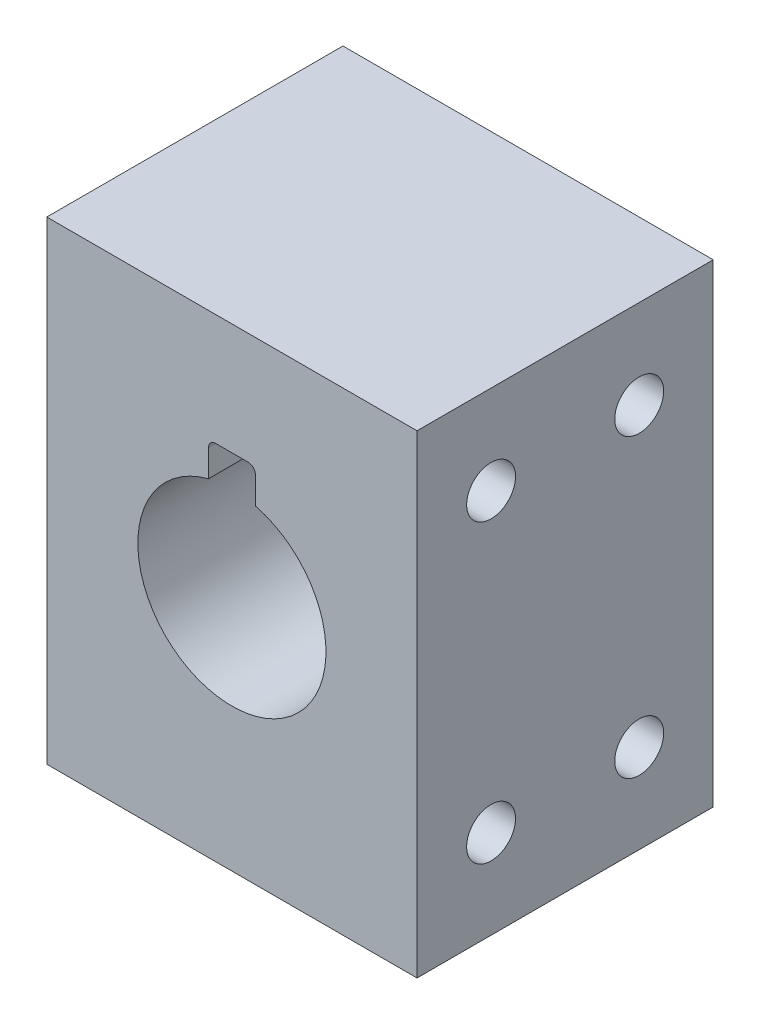
ISO-10303-21;
HEADER;
FILE_DESCRIPTION(('STEP AP214'),'2;1');
FILE_NAME('part.step','',(''),(''),'','','');
FILE_SCHEMA(('AUTOMOTIVE_DESIGN { 1 0 10303 214 1 1 1 1 }'));
ENDSEC;
DATA;
#1=APPLICATION_CONTEXT('core data for automotive mechanical design processes');
#2=APPLICATION_PROTOCOL_DEFINITION('international standard','automotive_design',2000,#1);
#3=PRODUCT_CONTEXT('',#1,'mechanical');
#4=PRODUCT('Part','Part','',(#3));
#5=PRODUCT_RELATED_PRODUCT_CATEGORY('part','',(#4));
#6=PRODUCT_DEFINITION_FORMATION('','',#4);
#7=PRODUCT_DEFINITION_CONTEXT('part definition',#1,'design');
#8=PRODUCT_DEFINITION('design','',#6,#7);
#9=PRODUCT_DEFINITION_SHAPE('','',#8);
#10=(LENGTH_UNIT() NAMED_UNIT(*) SI_UNIT(.MILLI.,.METRE.));
#11=(NAMED_UNIT(*) PLANE_ANGLE_UNIT() SI_UNIT($,.RADIAN.));
#12=(NAMED_UNIT(*) SI_UNIT($,.STERADIAN.) SOLID_ANGLE_UNIT());
#13=UNCERTAINTY_MEASURE_WITH_UNIT(LENGTH_MEASURE(1.E-05),#10,'distance_accuracy_value','');
#14=(GEOMETRIC_REPRESENTATION_CONTEXT(3) GLOBAL_UNCERTAINTY_ASSIGNED_CONTEXT((#13)) GLOBAL_UNIT_ASSIGNED_CONTEXT((#10,
#11,#12)) REPRESENTATION_CONTEXT('',''));
#15=CARTESIAN_POINT('',(0.,0.,0.));
#16=DIRECTION('',(0.,0.,1.));
#17=DIRECTION('',(1.,0.,0.));
#18=AXIS2_PLACEMENT_3D('',#15,#16,#17);
#19=CARTESIAN_POINT('',(0.,0.,20.));
#20=DIRECTION('',(-1.,0.,0.));
#21=DIRECTION('',(0.,-1.,0.));
#22=AXIS2_PLACEMENT_3D('',#19,#20,#21);
#23=PLANE('',#22);
#24=CARTESIAN_POINT('',(0.,26.,5.));
#25=DIRECTION('',(1.,0.,0.));
#26=DIRECTION('',(0.,0.,-1.));
#27=AXIS2_PLACEMENT_3D('',#24,#25,#26);
#28=CIRCLE('',#27,1.64999999999999);
#29=CARTESIAN_POINT('',(0.,26.,3.35000000000001));
#30=VERTEX_POINT('',#29);
#31=EDGE_CURVE('E152',#30,#30,#28,.T.);
#32=ORIENTED_EDGE('',*,*,#31,.F.);
#33=EDGE_LOOP('',(#32));
#34=FACE_BOUND('',#33,.T.);
#35=CARTESIAN_POINT('',(0.,5.99999999999999,15.));
#36=DIRECTION('',(1.,0.,0.));
#37=DIRECTION('',(0.,0.,-1.));
#38=AXIS2_PLACEMENT_3D('',#35,#36,#37);
#39=CIRCLE('',#38,1.64999999999999);
#40=CARTESIAN_POINT('',(0.,5.99999999999999,13.35));
#41=VERTEX_POINT('',#40);
#42=EDGE_CURVE('E151',#41,#41,#39,.T.);
#43=ORIENTED_EDGE('',*,*,#42,.F.);
#44=EDGE_LOOP('',(#43));
#45=FACE_BOUND('',#44,.T.);
#46=CARTESIAN_POINT('',(0.,5.99999999999999,5.));
#47=DIRECTION('',(1.,0.,0.));
#48=DIRECTION('',(0.,0.,-1.));
#49=AXIS2_PLACEMENT_3D('',#46,#47,#48);
#50=CIRCLE('',#49,1.64999999999999);
#51=CARTESIAN_POINT('',(0.,5.99999999999999,3.35000000000001));
#52=VERTEX_POINT('',#51);
#53=EDGE_CURVE('E165',#52,#52,#50,.T.);
#54=ORIENTED_EDGE('',*,*,#53,.F.);
#55=EDGE_LOOP('',(#54));
#56=FACE_BOUND('',#55,.T.);
#57=CARTESIAN_POINT('',(0.,26.,15.));
#58=DIRECTION('',(1.,0.,0.));
#59=DIRECTION('',(0.,0.,-1.));
#60=AXIS2_PLACEMENT_3D('',#57,#58,#59);
#61=CIRCLE('',#60,1.64999999999999);
#62=CARTESIAN_POINT('',(0.,26.,13.35));
#63=VERTEX_POINT('',#62);
#64=EDGE_CURVE('E173',#63,#63,#61,.T.);
#65=ORIENTED_EDGE('',*,*,#64,.F.);
#66=EDGE_LOOP('',(#65));
#67=FACE_BOUND('',#66,.T.);
#68=DIRECTION('',(0.,1.,0.));
#69=VECTOR('',#68,1.);
#70=CARTESIAN_POINT('',(0.,0.,0.));
#71=LINE('',#70,#69);
#72=CARTESIAN_POINT('',(0.,0.,0.));
#73=VERTEX_POINT('',#72);
#74=CARTESIAN_POINT('',(0.,32.,0.));
#75=VERTEX_POINT('',#74);
#76=EDGE_CURVE('E246',#73,#75,#71,.T.);
#77=ORIENTED_EDGE('',*,*,#76,.T.);
#78=DIRECTION('',(0.,0.,-1.));
#79=VECTOR('',#78,1.);
#80=CARTESIAN_POINT('',(0.,32.,20.));
#81=LINE('',#80,#79);
#82=CARTESIAN_POINT('',(0.,32.,20.));
#83=VERTEX_POINT('',#82);
#84=EDGE_CURVE('E287',#83,#75,#81,.T.);
#85=ORIENTED_EDGE('',*,*,#84,.F.);
#86=DIRECTION('',(0.,1.,0.));
#87=VECTOR('',#86,1.);
#88=CARTESIAN_POINT('',(0.,0.,20.));
#89=LINE('',#88,#87);
#90=CARTESIAN_POINT('',(0.,0.,20.));
#91=VERTEX_POINT('',#90);
#92=EDGE_CURVE('E250',#91,#83,#89,.T.);
#93=ORIENTED_EDGE('',*,*,#92,.F.);
#94=DIRECTION('',(0.,0.,-1.));
#95=VECTOR('',#94,1.);
#96=CARTESIAN_POINT('',(0.,0.,20.));
#97=LINE('',#96,#95);
#98=EDGE_CURVE('E264',#91,#73,#97,.T.);
#99=ORIENTED_EDGE('',*,*,#98,.T.);
#100=EDGE_LOOP('',(#77,#85,#93,#99));
#101=FACE_BOUND('',#100,.T.);
#102=ADVANCED_FACE('F41',(#34,#45,#56,#67,#101),#23,.F.);
#103=CARTESIAN_POINT('',(0.,32.,20.));
#104=DIRECTION('',(0.,-1.,0.));
#105=DIRECTION('',(0.,0.,-1.));
#106=AXIS2_PLACEMENT_3D('',#103,#104,#105);
#107=PLANE('',#106);
#108=DIRECTION('',(-1.,0.,0.));
#109=VECTOR('',#108,1.);
#110=CARTESIAN_POINT('',(0.,32.,0.));
#111=LINE('',#110,#109);
#112=CARTESIAN_POINT('',(-25.,32.,0.));
#113=VERTEX_POINT('',#112);
#114=EDGE_CURVE('E268',#75,#113,#111,.T.);
#115=ORIENTED_EDGE('',*,*,#114,.T.);
#116=DIRECTION('',(0.,0.,-1.));
#117=VECTOR('',#116,1.);
#118=CARTESIAN_POINT('',(-25.,32.,20.));
#119=LINE('',#118,#117);
#120=CARTESIAN_POINT('',(-25.,32.,20.));
#121=VERTEX_POINT('',#120);
#122=EDGE_CURVE('E283',#121,#113,#119,.T.);
#123=ORIENTED_EDGE('',*,*,#122,.F.);
#124=DIRECTION('',(-1.,0.,0.));
#125=VECTOR('',#124,1.);
#126=CARTESIAN_POINT('',(0.,32.,20.));
#127=LINE('',#126,#125);
#128=EDGE_CURVE('E254',#83,#121,#127,.T.);
#129=ORIENTED_EDGE('',*,*,#128,.F.);
#130=ORIENTED_EDGE('',*,*,#84,.T.);
#131=EDGE_LOOP('',(#115,#123,#129,#130));
#132=FACE_BOUND('',#131,.T.);
#133=ADVANCED_FACE('F344',(#132),#107,.F.);
#134=CARTESIAN_POINT('',(-25.,0.,20.));
#135=DIRECTION('',(1.,0.,0.));
#136=DIRECTION('',(0.,0.,-1.));
#137=AXIS2_PLACEMENT_3D('',#134,#135,#136);
#138=PLANE('',#137);
#139=CARTESIAN_POINT('',(-25.,26.,5.));
#140=DIRECTION('',(-1.,0.,0.));
#141=DIRECTION('',(0.,0.,1.));
#142=AXIS2_PLACEMENT_3D('',#139,#140,#141);
#143=CIRCLE('',#142,1.64999999999999);
#144=CARTESIAN_POINT('',(-25.,26.,6.64999999999999));
#145=VERTEX_POINT('',#144);
#146=EDGE_CURVE('E181',#145,#145,#143,.T.);
#147=ORIENTED_EDGE('',*,*,#146,.F.);
#148=EDGE_LOOP('',(#147));
#149=FACE_BOUND('',#148,.T.);
#150=CARTESIAN_POINT('',(-25.,5.99999999999999,15.));
#151=DIRECTION('',(-1.,0.,0.));
#152=DIRECTION('',(0.,0.,1.));
#153=AXIS2_PLACEMENT_3D('',#150,#151,#152);
#154=CIRCLE('',#153,1.64999999999999);
#155=CARTESIAN_POINT('',(-25.,5.99999999999999,16.65));
#156=VERTEX_POINT('',#155);
#157=EDGE_CURVE('E189',#156,#156,#154,.T.);
#158=ORIENTED_EDGE('',*,*,#157,.F.);
#159=EDGE_LOOP('',(#158));
#160=FACE_BOUND('',#159,.T.);
#161=CARTESIAN_POINT('',(-25.,5.99999999999999,5.));
#162=DIRECTION('',(-1.,0.,0.));
#163=DIRECTION('',(0.,0.,1.));
#164=AXIS2_PLACEMENT_3D('',#161,#162,#163);
#165=CIRCLE('',#164,1.64999999999999);
#166=CARTESIAN_POINT('',(-25.,5.99999999999999,6.64999999999999));
#167=VERTEX_POINT('',#166);
#168=EDGE_CURVE('E197',#167,#167,#165,.T.);
#169=ORIENTED_EDGE('',*,*,#168,.F.);
#170=EDGE_LOOP('',(#169));
#171=FACE_BOUND('',#170,.T.);
#172=CARTESIAN_POINT('',(-25.,26.,15.));
#173=DIRECTION('',(-1.,0.,0.));
#174=DIRECTION('',(0.,0.,1.));
#175=AXIS2_PLACEMENT_3D('',#172,#173,#174);
#176=CIRCLE('',#175,1.64999999999999);
#177=CARTESIAN_POINT('',(-25.,26.,16.65));
#178=VERTEX_POINT('',#177);
#179=EDGE_CURVE('E205',#178,#178,#176,.T.);
#180=ORIENTED_EDGE('',*,*,#179,.F.);
#181=EDGE_LOOP('',(#180));
#182=FACE_BOUND('',#181,.T.);
#183=DIRECTION('',(0.,-1.,0.));
#184=VECTOR('',#183,1.);
#185=CARTESIAN_POINT('',(-25.,0.,0.));
#186=LINE('',#185,#184);
#187=CARTESIAN_POINT('',(-25.,0.,0.));
#188=VERTEX_POINT('',#187);
#189=EDGE_CURVE('E271',#113,#188,#186,.T.);
#190=ORIENTED_EDGE('',*,*,#189,.T.);
#191=DIRECTION('',(0.,0.,-1.));
#192=VECTOR('',#191,1.);
#193=CARTESIAN_POINT('',(-25.,0.,20.));
#194=LINE('',#193,#192);
#195=CARTESIAN_POINT('',(-25.,0.,20.));
#196=VERTEX_POINT('',#195);
#197=EDGE_CURVE('E279',#196,#188,#194,.T.);
#198=ORIENTED_EDGE('',*,*,#197,.F.);
#199=DIRECTION('',(0.,-1.,0.));
#200=VECTOR('',#199,1.);
#201=CARTESIAN_POINT('',(-25.,0.,20.));
#202=LINE('',#201,#200);
#203=EDGE_CURVE('E258',#121,#196,#202,.T.);
#204=ORIENTED_EDGE('',*,*,#203,.F.);
#205=ORIENTED_EDGE('',*,*,#122,.T.);
#206=EDGE_LOOP('',(#190,#198,#204,#205));
#207=FACE_BOUND('',#206,.T.);
#208=ADVANCED_FACE('F349',(#149,#160,#171,#182,#207),#138,.F.);
#209=CARTESIAN_POINT('',(0.,0.,20.));
#210=DIRECTION('',(0.,1.,0.));
#211=DIRECTION('',(-1.,0.,0.));
#212=AXIS2_PLACEMENT_3D('',#209,#210,#211);
#213=PLANE('',#212);
#214=DIRECTION('',(1.,0.,0.));
#215=VECTOR('',#214,1.);
#216=CARTESIAN_POINT('',(0.,0.,0.));
#217=LINE('',#216,#215);
#218=EDGE_CURVE('E255',#188,#73,#217,.T.);
#219=ORIENTED_EDGE('',*,*,#218,.T.);
#220=ORIENTED_EDGE('',*,*,#98,.F.);
#221=DIRECTION('',(1.,0.,0.));
#222=VECTOR('',#221,1.);
#223=CARTESIAN_POINT('',(0.,0.,20.));
#224=LINE('',#223,#222);
#225=EDGE_CURVE('E261',#196,#91,#224,.T.);
#226=ORIENTED_EDGE('',*,*,#225,.F.);
#227=ORIENTED_EDGE('',*,*,#197,.T.);
#228=EDGE_LOOP('',(#219,#220,#226,#227));
#229=FACE_BOUND('',#228,.T.);
#230=ADVANCED_FACE('F357',(#229),#213,.F.);
#231=CARTESIAN_POINT('',(0.,0.,20.));
#232=DIRECTION('',(0.,0.,1.));
#233=DIRECTION('',(1.,0.,0.));
#234=AXIS2_PLACEMENT_3D('',#231,#232,#233);
#235=PLANE('',#234);
#236=CARTESIAN_POINT('',(-12.5,16.,20.));
#237=DIRECTION('',(0.,0.,1.));
#238=DIRECTION('',(1.,0.,0.));
#239=AXIS2_PLACEMENT_3D('',#236,#237,#238);
#240=CIRCLE('',#239,6.35);
#241=CARTESIAN_POINT('',(-14.0875,22.1483610621043,20.));
#242=VERTEX_POINT('',#241);
#243=CARTESIAN_POINT('',(-10.9125,22.1483610621043,20.));
#244=VERTEX_POINT('',#243);
#245=EDGE_CURVE('E213',#242,#244,#240,.T.);
#246=ORIENTED_EDGE('',*,*,#245,.F.);
#247=DIRECTION('',(0.,-1.,0.));
#248=VECTOR('',#247,1.);
#249=CARTESIAN_POINT('',(-14.0875,0.,20.));
#250=LINE('',#249,#248);
#251=CARTESIAN_POINT('',(-14.0875,23.9625,20.));
#252=VERTEX_POINT('',#251);
#253=EDGE_CURVE('E219',#252,#242,#250,.T.);
#254=ORIENTED_EDGE('',*,*,#253,.F.);
#255=CARTESIAN_POINT('',(-13.5875,23.9625,20.));
#256=DIRECTION('',(0.,0.,1.));
#257=DIRECTION('',(1.,0.,0.));
#258=AXIS2_PLACEMENT_3D('',#255,#256,#257);
#259=CIRCLE('',#258,0.5);
#260=CARTESIAN_POINT('',(-13.5875,24.4625,20.));
#261=VERTEX_POINT('',#260);
#262=EDGE_CURVE('E50',#252,#261,#259,.F.);
#263=ORIENTED_EDGE('',*,*,#262,.T.);
#264=DIRECTION('',(1.,0.,0.));
#265=VECTOR('',#264,1.);
#266=CARTESIAN_POINT('',(0.,24.4625,20.));
#267=LINE('',#266,#265);
#268=CARTESIAN_POINT('',(-11.4125,24.4625,20.));
#269=VERTEX_POINT('',#268);
#270=EDGE_CURVE('E236',#261,#269,#267,.T.);
#271=ORIENTED_EDGE('',*,*,#270,.T.);
#272=CARTESIAN_POINT('',(-11.4125,23.9625,20.));
#273=DIRECTION('',(0.,0.,1.));
#274=DIRECTION('',(1.,0.,0.));
#275=AXIS2_PLACEMENT_3D('',#272,#273,#274);
#276=CIRCLE('',#275,0.5);
#277=CARTESIAN_POINT('',(-10.9125,23.9625,20.));
#278=VERTEX_POINT('',#277);
#279=EDGE_CURVE('E304',#269,#278,#276,.F.);
#280=ORIENTED_EDGE('',*,*,#279,.T.);
#281=DIRECTION('',(0.,-1.,0.));
#282=VECTOR('',#281,1.);
#283=CARTESIAN_POINT('',(-10.9125,0.,20.));
#284=LINE('',#283,#282);
#285=EDGE_CURVE('E233',#278,#244,#284,.T.);
#286=ORIENTED_EDGE('',*,*,#285,.T.);
#287=EDGE_LOOP('',(#246,#254,#263,#271,#280,#286));
#288=FACE_BOUND('',#287,.T.);
#289=ORIENTED_EDGE('',*,*,#92,.T.);
#290=ORIENTED_EDGE('',*,*,#128,.T.);
#291=ORIENTED_EDGE('',*,*,#203,.T.);
#292=ORIENTED_EDGE('',*,*,#225,.T.);
#293=EDGE_LOOP('',(#289,#290,#291,#292));
#294=FACE_BOUND('',#293,.T.);
#295=ADVANCED_FACE('F314',(#288,#294),#235,.T.);
#296=CARTESIAN_POINT('',(0.,0.,0.));
#297=DIRECTION('',(0.,0.,1.));
#298=DIRECTION('',(1.,0.,0.));
#299=AXIS2_PLACEMENT_3D('',#296,#297,#298);
#300=PLANE('',#299);
#301=DIRECTION('',(1.,0.,0.));
#302=VECTOR('',#301,1.);
#303=CARTESIAN_POINT('',(0.,24.4625,0.));
#304=LINE('',#303,#302);
#305=CARTESIAN_POINT('',(-13.5875,24.4625,0.));
#306=VERTEX_POINT('',#305);
#307=CARTESIAN_POINT('',(-11.4125,24.4625,0.));
#308=VERTEX_POINT('',#307);
#309=EDGE_CURVE('E222',#306,#308,#304,.T.);
#310=ORIENTED_EDGE('',*,*,#309,.F.);
#311=CARTESIAN_POINT('',(-13.5875,23.9625,0.));
#312=DIRECTION('',(0.,0.,1.));
#313=DIRECTION('',(1.,0.,0.));
#314=AXIS2_PLACEMENT_3D('',#311,#312,#313);
#315=CIRCLE('',#314,0.5);
#316=CARTESIAN_POINT('',(-14.0875,23.9625,0.));
#317=VERTEX_POINT('',#316);
#318=EDGE_CURVE('E11',#306,#317,#315,.T.);
#319=ORIENTED_EDGE('',*,*,#318,.T.);
#320=DIRECTION('',(0.,-1.,0.));
#321=VECTOR('',#320,1.);
#322=CARTESIAN_POINT('',(-14.0875,0.,0.));
#323=LINE('',#322,#321);
#324=CARTESIAN_POINT('',(-14.0875,22.1483610621043,0.));
#325=VERTEX_POINT('',#324);
#326=EDGE_CURVE('E226',#317,#325,#323,.T.);
#327=ORIENTED_EDGE('',*,*,#326,.T.);
#328=CARTESIAN_POINT('',(-12.5,16.,0.));
#329=DIRECTION('',(0.,0.,1.));
#330=DIRECTION('',(1.,0.,0.));
#331=AXIS2_PLACEMENT_3D('',#328,#329,#330);
#332=CIRCLE('',#331,6.35);
#333=CARTESIAN_POINT('',(-10.9125,22.1483610621043,0.));
#334=VERTEX_POINT('',#333);
#335=EDGE_CURVE('E214',#325,#334,#332,.T.);
#336=ORIENTED_EDGE('',*,*,#335,.T.);
#337=DIRECTION('',(0.,-1.,0.));
#338=VECTOR('',#337,1.);
#339=CARTESIAN_POINT('',(-10.9125,0.,0.));
#340=LINE('',#339,#338);
#341=CARTESIAN_POINT('',(-10.9125,23.9625,0.));
#342=VERTEX_POINT('',#341);
#343=EDGE_CURVE('E218',#342,#334,#340,.T.);
#344=ORIENTED_EDGE('',*,*,#343,.F.);
#345=CARTESIAN_POINT('',(-11.4125,23.9625,0.));
#346=DIRECTION('',(0.,0.,1.));
#347=DIRECTION('',(1.,0.,0.));
#348=AXIS2_PLACEMENT_3D('',#345,#346,#347);
#349=CIRCLE('',#348,0.5);
#350=EDGE_CURVE('E307',#342,#308,#349,.T.);
#351=ORIENTED_EDGE('',*,*,#350,.T.);
#352=EDGE_LOOP('',(#310,#319,#327,#336,#344,#351));
#353=FACE_BOUND('',#352,.T.);
#354=ORIENTED_EDGE('',*,*,#76,.F.);
#355=ORIENTED_EDGE('',*,*,#218,.F.);
#356=ORIENTED_EDGE('',*,*,#189,.F.);
#357=ORIENTED_EDGE('',*,*,#114,.F.);
#358=EDGE_LOOP('',(#354,#355,#356,#357));
#359=FACE_BOUND('',#358,.T.);
#360=ADVANCED_FACE('F323',(#353,#359),#300,.F.);
#361=CARTESIAN_POINT('',(-12.5,16.,0.));
#362=DIRECTION('',(0.,0.,1.));
#363=DIRECTION('',(1.,0.,0.));
#364=AXIS2_PLACEMENT_3D('',#361,#362,#363);
#365=CYLINDRICAL_SURFACE('',#364,6.35);
#366=ORIENTED_EDGE('',*,*,#245,.T.);
#367=DIRECTION('',(0.,0.,1.));
#368=VECTOR('',#367,1.);
#369=CARTESIAN_POINT('',(-10.9125,22.1483610621043,0.));
#370=LINE('',#369,#368);
#371=EDGE_CURVE('E229',#334,#244,#370,.T.);
#372=ORIENTED_EDGE('',*,*,#371,.F.);
#373=ORIENTED_EDGE('',*,*,#335,.F.);
#374=DIRECTION('',(0.,0.,1.));
#375=VECTOR('',#374,1.);
#376=CARTESIAN_POINT('',(-14.0875,22.1483610621043,0.));
#377=LINE('',#376,#375);
#378=EDGE_CURVE('E242',#325,#242,#377,.T.);
#379=ORIENTED_EDGE('',*,*,#378,.T.);
#380=EDGE_LOOP('',(#366,#372,#373,#379));
#381=FACE_BOUND('',#380,.T.);
#382=ADVANCED_FACE('F329',(#381),#365,.F.);
#383=CARTESIAN_POINT('',(-14.0875,0.,0.));
#384=DIRECTION('',(-1.,0.,0.));
#385=DIRECTION('',(0.,-1.,0.));
#386=AXIS2_PLACEMENT_3D('',#383,#384,#385);
#387=PLANE('',#386);
#388=ORIENTED_EDGE('',*,*,#326,.F.);
#389=DIRECTION('',(0.,0.,1.));
#390=VECTOR('',#389,1.);
#391=CARTESIAN_POINT('',(-14.0875,23.9625,0.));
#392=LINE('',#391,#390);
#393=EDGE_CURVE('E301',#317,#252,#392,.T.);
#394=ORIENTED_EDGE('',*,*,#393,.T.);
#395=ORIENTED_EDGE('',*,*,#253,.T.);
#396=ORIENTED_EDGE('',*,*,#378,.F.);
#397=EDGE_LOOP('',(#388,#394,#395,#396));
#398=FACE_BOUND('',#397,.T.);
#399=ADVANCED_FACE('F320',(#398),#387,.F.);
#400=CARTESIAN_POINT('',(0.,24.4625,0.));
#401=DIRECTION('',(0.,-1.,0.));
#402=DIRECTION('',(0.,0.,-1.));
#403=AXIS2_PLACEMENT_3D('',#400,#401,#402);
#404=PLANE('',#403);
#405=ORIENTED_EDGE('',*,*,#309,.T.);
#406=DIRECTION('',(0.,0.,1.));
#407=VECTOR('',#406,1.);
#408=CARTESIAN_POINT('',(-11.4125,24.4625,20.));
#409=LINE('',#408,#407);
#410=EDGE_CURVE('E294',#308,#269,#409,.T.);
#411=ORIENTED_EDGE('',*,*,#410,.T.);
#412=ORIENTED_EDGE('',*,*,#270,.F.);
#413=DIRECTION('',(0.,0.,1.));
#414=VECTOR('',#413,1.);
#415=CARTESIAN_POINT('',(-13.5875,24.4625,0.));
#416=LINE('',#415,#414);
#417=EDGE_CURVE('E291',#261,#306,#416,.F.);
#418=ORIENTED_EDGE('',*,*,#417,.T.);
#419=EDGE_LOOP('',(#405,#411,#412,#418));
#420=FACE_BOUND('',#419,.T.);
#421=ADVANCED_FACE('F317',(#420),#404,.T.);
#422=CARTESIAN_POINT('',(-10.9125,0.,0.));
#423=DIRECTION('',(-1.,0.,0.));
#424=DIRECTION('',(0.,-1.,0.));
#425=AXIS2_PLACEMENT_3D('',#422,#423,#424);
#426=PLANE('',#425);
#427=ORIENTED_EDGE('',*,*,#285,.F.);
#428=DIRECTION('',(0.,0.,1.));
#429=VECTOR('',#428,1.);
#430=CARTESIAN_POINT('',(-10.9125,23.9625,0.));
#431=LINE('',#430,#429);
#432=EDGE_CURVE('E298',#278,#342,#431,.F.);
#433=ORIENTED_EDGE('',*,*,#432,.T.);
#434=ORIENTED_EDGE('',*,*,#343,.T.);
#435=ORIENTED_EDGE('',*,*,#371,.T.);
#436=EDGE_LOOP('',(#427,#433,#434,#435));
#437=FACE_BOUND('',#436,.T.);
#438=ADVANCED_FACE('F332',(#437),#426,.T.);
#439=CARTESIAN_POINT('',(-18.,26.,15.));
#440=DIRECTION('',(-1.,0.,0.));
#441=DIRECTION('',(0.,0.,1.));
#442=AXIS2_PLACEMENT_3D('',#439,#440,#441);
#443=CONICAL_SURFACE('',#442,1.65,1.02974425867665);
#444=CARTESIAN_POINT('',(-17.0085799786045,26.,15.));
#445=VERTEX_POINT('',#444);
#446=VERTEX_LOOP('',#445);
#447=FACE_BOUND('',#446,.T.);
#448=CARTESIAN_POINT('',(-18.,26.,15.));
#449=DIRECTION('',(-1.,0.,0.));
#450=DIRECTION('',(0.,0.,1.));
#451=AXIS2_PLACEMENT_3D('',#448,#449,#450);
#452=CIRCLE('',#451,1.65);
#453=CARTESIAN_POINT('',(-18.,26.,16.65));
#454=VERTEX_POINT('',#453);
#455=EDGE_CURVE('E209',#454,#454,#452,.T.);
#456=ORIENTED_EDGE('',*,*,#455,.T.);
#457=EDGE_LOOP('',(#456));
#458=FACE_BOUND('',#457,.T.);
#459=ADVANCED_FACE('F370',(#447,#458),#443,.F.);
#460=CARTESIAN_POINT('',(-25.,26.,15.));
#461=DIRECTION('',(-1.,0.,0.));
#462=DIRECTION('',(0.,0.,1.));
#463=AXIS2_PLACEMENT_3D('',#460,#461,#462);
#464=CYLINDRICAL_SURFACE('',#463,1.65);
#465=ORIENTED_EDGE('',*,*,#455,.F.);
#466=EDGE_LOOP('',(#465));
#467=FACE_BOUND('',#466,.T.);
#468=ORIENTED_EDGE('',*,*,#179,.T.);
#469=EDGE_LOOP('',(#468));
#470=FACE_BOUND('',#469,.T.);
#471=ADVANCED_FACE('F377',(#467,#470),#464,.F.);
#472=CARTESIAN_POINT('',(-18.,5.99999999999999,5.));
#473=DIRECTION('',(-1.,0.,0.));
#474=DIRECTION('',(0.,0.,1.));
#475=AXIS2_PLACEMENT_3D('',#472,#473,#474);
#476=CONICAL_SURFACE('',#475,1.65,1.02974425867665);
#477=CARTESIAN_POINT('',(-17.0085799786045,5.99999999999999,5.));
#478=VERTEX_POINT('',#477);
#479=VERTEX_LOOP('',#478);
#480=FACE_BOUND('',#479,.T.);
#481=CARTESIAN_POINT('',(-18.,5.99999999999999,5.));
#482=DIRECTION('',(-1.,0.,0.));
#483=DIRECTION('',(0.,0.,1.));
#484=AXIS2_PLACEMENT_3D('',#481,#482,#483);
#485=CIRCLE('',#484,1.65);
#486=CARTESIAN_POINT('',(-18.,5.99999999999999,6.64999999999999));
#487=VERTEX_POINT('',#486);
#488=EDGE_CURVE('E201',#487,#487,#485,.T.);
#489=ORIENTED_EDGE('',*,*,#488,.T.);
#490=EDGE_LOOP('',(#489));
#491=FACE_BOUND('',#490,.T.);
#492=ADVANCED_FACE('F381',(#480,#491),#476,.F.);
#493=CARTESIAN_POINT('',(-25.,5.99999999999999,5.));
#494=DIRECTION('',(-1.,0.,0.));
#495=DIRECTION('',(0.,0.,1.));
#496=AXIS2_PLACEMENT_3D('',#493,#494,#495);
#497=CYLINDRICAL_SURFACE('',#496,1.64999999999999);
#498=ORIENTED_EDGE('',*,*,#488,.F.);
#499=EDGE_LOOP('',(#498));
#500=FACE_BOUND('',#499,.T.);
#501=ORIENTED_EDGE('',*,*,#168,.T.);
#502=EDGE_LOOP('',(#501));
#503=FACE_BOUND('',#502,.T.);
#504=ADVANCED_FACE('F385',(#500,#503),#497,.F.);
#505=CARTESIAN_POINT('',(-18.,5.99999999999999,15.));
#506=DIRECTION('',(-1.,0.,0.));
#507=DIRECTION('',(0.,0.,1.));
#508=AXIS2_PLACEMENT_3D('',#505,#506,#507);
#509=CONICAL_SURFACE('',#508,1.65,1.02974425867665);
#510=CARTESIAN_POINT('',(-17.0085799786045,5.99999999999999,15.));
#511=VERTEX_POINT('',#510);
#512=VERTEX_LOOP('',#511);
#513=FACE_BOUND('',#512,.T.);
#514=CARTESIAN_POINT('',(-18.,5.99999999999999,15.));
#515=DIRECTION('',(-1.,0.,0.));
#516=DIRECTION('',(0.,0.,1.));
#517=AXIS2_PLACEMENT_3D('',#514,#515,#516);
#518=CIRCLE('',#517,1.65);
#519=CARTESIAN_POINT('',(-18.,5.99999999999999,16.65));
#520=VERTEX_POINT('',#519);
#521=EDGE_CURVE('E193',#520,#520,#518,.T.);
#522=ORIENTED_EDGE('',*,*,#521,.T.);
#523=EDGE_LOOP('',(#522));
#524=FACE_BOUND('',#523,.T.);
#525=ADVANCED_FACE('F389',(#513,#524),#509,.F.);
#526=CARTESIAN_POINT('',(-25.,5.99999999999999,15.));
#527=DIRECTION('',(-1.,0.,0.));
#528=DIRECTION('',(0.,0.,1.));
#529=AXIS2_PLACEMENT_3D('',#526,#527,#528);
#530=CYLINDRICAL_SURFACE('',#529,1.64999999999999);
#531=ORIENTED_EDGE('',*,*,#521,.F.);
#532=EDGE_LOOP('',(#531));
#533=FACE_BOUND('',#532,.T.);
#534=ORIENTED_EDGE('',*,*,#157,.T.);
#535=EDGE_LOOP('',(#534));
#536=FACE_BOUND('',#535,.T.);
#537=ADVANCED_FACE('F393',(#533,#536),#530,.F.);
#538=CARTESIAN_POINT('',(-18.,26.,5.));
#539=DIRECTION('',(-1.,0.,0.));
#540=DIRECTION('',(0.,0.,1.));
#541=AXIS2_PLACEMENT_3D('',#538,#539,#540);
#542=CONICAL_SURFACE('',#541,1.65,1.02974425867665);
#543=CARTESIAN_POINT('',(-17.0085799786045,26.,5.));
#544=VERTEX_POINT('',#543);
#545=VERTEX_LOOP('',#544);
#546=FACE_BOUND('',#545,.T.);
#547=CARTESIAN_POINT('',(-18.,26.,5.));
#548=DIRECTION('',(-1.,0.,0.));
#549=DIRECTION('',(0.,0.,1.));
#550=AXIS2_PLACEMENT_3D('',#547,#548,#549);
#551=CIRCLE('',#550,1.65);
#552=CARTESIAN_POINT('',(-18.,26.,6.65));
#553=VERTEX_POINT('',#552);
#554=EDGE_CURVE('E185',#553,#553,#551,.T.);
#555=ORIENTED_EDGE('',*,*,#554,.T.);
#556=EDGE_LOOP('',(#555));
#557=FACE_BOUND('',#556,.T.);
#558=ADVANCED_FACE('F397',(#546,#557),#542,.F.);
#559=CARTESIAN_POINT('',(-25.,26.,5.));
#560=DIRECTION('',(-1.,0.,0.));
#561=DIRECTION('',(0.,0.,1.));
#562=AXIS2_PLACEMENT_3D('',#559,#560,#561);
#563=CYLINDRICAL_SURFACE('',#562,1.65);
#564=ORIENTED_EDGE('',*,*,#554,.F.);
#565=EDGE_LOOP('',(#564));
#566=FACE_BOUND('',#565,.T.);
#567=ORIENTED_EDGE('',*,*,#146,.T.);
#568=EDGE_LOOP('',(#567));
#569=FACE_BOUND('',#568,.T.);
#570=ADVANCED_FACE('F401',(#566,#569),#563,.F.);
#571=CARTESIAN_POINT('',(-7.,26.,15.));
#572=DIRECTION('',(1.,0.,0.));
#573=DIRECTION('',(0.,0.,-1.));
#574=AXIS2_PLACEMENT_3D('',#571,#572,#573);
#575=CONICAL_SURFACE('',#574,1.65,1.02974425867665);
#576=CARTESIAN_POINT('',(-7.99142002139547,26.,15.));
#577=VERTEX_POINT('',#576);
#578=VERTEX_LOOP('',#577);
#579=FACE_BOUND('',#578,.T.);
#580=CARTESIAN_POINT('',(-7.,26.,15.));
#581=DIRECTION('',(1.,0.,0.));
#582=DIRECTION('',(0.,0.,-1.));
#583=AXIS2_PLACEMENT_3D('',#580,#581,#582);
#584=CIRCLE('',#583,1.65);
#585=CARTESIAN_POINT('',(-7.,26.,13.35));
#586=VERTEX_POINT('',#585);
#587=EDGE_CURVE('E177',#586,#586,#584,.T.);
#588=ORIENTED_EDGE('',*,*,#587,.T.);
#589=EDGE_LOOP('',(#588));
#590=FACE_BOUND('',#589,.T.);
#591=ADVANCED_FACE('F405',(#579,#590),#575,.F.);
#592=CARTESIAN_POINT('',(0.,26.,15.));
#593=DIRECTION('',(1.,0.,0.));
#594=DIRECTION('',(0.,0.,-1.));
#595=AXIS2_PLACEMENT_3D('',#592,#593,#594);
#596=CYLINDRICAL_SURFACE('',#595,1.65);
#597=ORIENTED_EDGE('',*,*,#587,.F.);
#598=EDGE_LOOP('',(#597));
#599=FACE_BOUND('',#598,.T.);
#600=ORIENTED_EDGE('',*,*,#64,.T.);
#601=EDGE_LOOP('',(#600));
#602=FACE_BOUND('',#601,.T.);
#603=ADVANCED_FACE('F409',(#599,#602),#596,.F.);
#604=CARTESIAN_POINT('',(-7.,5.99999999999999,5.));
#605=DIRECTION('',(1.,0.,0.));
#606=DIRECTION('',(0.,0.,-1.));
#607=AXIS2_PLACEMENT_3D('',#604,#605,#606);
#608=CONICAL_SURFACE('',#607,1.65,1.02974425867665);
#609=CARTESIAN_POINT('',(-7.99142002139547,5.99999999999999,5.));
#610=VERTEX_POINT('',#609);
#611=VERTEX_LOOP('',#610);
#612=FACE_BOUND('',#611,.T.);
#613=CARTESIAN_POINT('',(-7.,5.99999999999999,5.));
#614=DIRECTION('',(1.,0.,0.));
#615=DIRECTION('',(0.,0.,-1.));
#616=AXIS2_PLACEMENT_3D('',#613,#614,#615);
#617=CIRCLE('',#616,1.65);
#618=CARTESIAN_POINT('',(-7.,5.99999999999999,3.35));
#619=VERTEX_POINT('',#618);
#620=EDGE_CURVE('E169',#619,#619,#617,.T.);
#621=ORIENTED_EDGE('',*,*,#620,.T.);
#622=EDGE_LOOP('',(#621));
#623=FACE_BOUND('',#622,.T.);
#624=ADVANCED_FACE('F413',(#612,#623),#608,.F.);
#625=CARTESIAN_POINT('',(0.,5.99999999999999,5.));
#626=DIRECTION('',(1.,0.,0.));
#627=DIRECTION('',(0.,0.,-1.));
#628=AXIS2_PLACEMENT_3D('',#625,#626,#627);
#629=CYLINDRICAL_SURFACE('',#628,1.64999999999999);
#630=ORIENTED_EDGE('',*,*,#620,.F.);
#631=EDGE_LOOP('',(#630));
#632=FACE_BOUND('',#631,.T.);
#633=ORIENTED_EDGE('',*,*,#53,.T.);
#634=EDGE_LOOP('',(#633));
#635=FACE_BOUND('',#634,.T.);
#636=ADVANCED_FACE('F417',(#632,#635),#629,.F.);
#637=CARTESIAN_POINT('',(-7.,5.99999999999999,15.));
#638=DIRECTION('',(1.,0.,0.));
#639=DIRECTION('',(0.,0.,-1.));
#640=AXIS2_PLACEMENT_3D('',#637,#638,#639);
#641=CONICAL_SURFACE('',#640,1.65,1.02974425867665);
#642=CARTESIAN_POINT('',(-7.99142002139547,5.99999999999999,15.));
#643=VERTEX_POINT('',#642);
#644=VERTEX_LOOP('',#643);
#645=FACE_BOUND('',#644,.T.);
#646=CARTESIAN_POINT('',(-7.,5.99999999999999,15.));
#647=DIRECTION('',(1.,0.,0.));
#648=DIRECTION('',(0.,0.,-1.));
#649=AXIS2_PLACEMENT_3D('',#646,#647,#648);
#650=CIRCLE('',#649,1.65);
#651=CARTESIAN_POINT('',(-7.,5.99999999999999,13.35));
#652=VERTEX_POINT('',#651);
#653=EDGE_CURVE('E157',#652,#652,#650,.T.);
#654=ORIENTED_EDGE('',*,*,#653,.T.);
#655=EDGE_LOOP('',(#654));
#656=FACE_BOUND('',#655,.T.);
#657=ADVANCED_FACE('F421',(#645,#656),#641,.F.);
#658=CARTESIAN_POINT('',(0.,5.99999999999999,15.));
#659=DIRECTION('',(1.,0.,0.));
#660=DIRECTION('',(0.,0.,-1.));
#661=AXIS2_PLACEMENT_3D('',#658,#659,#660);
#662=CYLINDRICAL_SURFACE('',#661,1.64999999999999);
#663=ORIENTED_EDGE('',*,*,#653,.F.);
#664=EDGE_LOOP('',(#663));
#665=FACE_BOUND('',#664,.T.);
#666=ORIENTED_EDGE('',*,*,#42,.T.);
#667=EDGE_LOOP('',(#666));
#668=FACE_BOUND('',#667,.T.);
#669=ADVANCED_FACE('F144',(#665,#668),#662,.F.);
#670=CARTESIAN_POINT('',(-7.,26.,5.));
#671=DIRECTION('',(1.,0.,0.));
#672=DIRECTION('',(0.,0.,-1.));
#673=AXIS2_PLACEMENT_3D('',#670,#671,#672);
#674=CONICAL_SURFACE('',#673,1.65,1.02974425867665);
#675=CARTESIAN_POINT('',(-7.99142002139547,26.,5.));
#676=VERTEX_POINT('',#675);
#677=VERTEX_LOOP('',#676);
#678=FACE_BOUND('',#677,.T.);
#679=CARTESIAN_POINT('',(-7.,26.,5.));
#680=DIRECTION('',(1.,0.,0.));
#681=DIRECTION('',(0.,0.,-1.));
#682=AXIS2_PLACEMENT_3D('',#679,#680,#681);
#683=CIRCLE('',#682,1.65);
#684=CARTESIAN_POINT('',(-7.,26.,3.35));
#685=VERTEX_POINT('',#684);
#686=EDGE_CURVE('E148',#685,#685,#683,.T.);
#687=ORIENTED_EDGE('',*,*,#686,.T.);
#688=EDGE_LOOP('',(#687));
#689=FACE_BOUND('',#688,.T.);
#690=ADVANCED_FACE('F140',(#678,#689),#674,.F.);
#691=CARTESIAN_POINT('',(0.,26.,5.));
#692=DIRECTION('',(1.,0.,0.));
#693=DIRECTION('',(0.,0.,-1.));
#694=AXIS2_PLACEMENT_3D('',#691,#692,#693);
#695=CYLINDRICAL_SURFACE('',#694,1.65);
#696=ORIENTED_EDGE('',*,*,#686,.F.);
#697=EDGE_LOOP('',(#696));
#698=FACE_BOUND('',#697,.T.);
#699=ORIENTED_EDGE('',*,*,#31,.T.);
#700=EDGE_LOOP('',(#699));
#701=FACE_BOUND('',#700,.T.);
#702=ADVANCED_FACE('F143',(#698,#701),#695,.F.);
#703=CARTESIAN_POINT('',(-11.4125,23.9625,0.));
#704=DIRECTION('',(0.,0.,-1.));
#705=DIRECTION('',(-1.,0.,0.));
#706=AXIS2_PLACEMENT_3D('',#703,#704,#705);
#707=CYLINDRICAL_SURFACE('',#706,0.5);
#708=ORIENTED_EDGE('',*,*,#350,.F.);
#709=ORIENTED_EDGE('',*,*,#432,.F.);
#710=ORIENTED_EDGE('',*,*,#279,.F.);
#711=ORIENTED_EDGE('',*,*,#410,.F.);
#712=EDGE_LOOP('',(#708,#709,#710,#711));
#713=FACE_BOUND('',#712,.T.);
#714=ADVANCED_FACE('F335',(#713),#707,.F.);
#715=CARTESIAN_POINT('',(-13.5875,23.9625,0.));
#716=DIRECTION('',(0.,0.,1.));
#717=DIRECTION('',(1.,0.,0.));
#718=AXIS2_PLACEMENT_3D('',#715,#716,#717);
#719=CYLINDRICAL_SURFACE('',#718,0.5);
#720=ORIENTED_EDGE('',*,*,#318,.F.);
#721=ORIENTED_EDGE('',*,*,#417,.F.);
#722=ORIENTED_EDGE('',*,*,#262,.F.);
#723=ORIENTED_EDGE('',*,*,#393,.F.);
#724=EDGE_LOOP('',(#720,#721,#722,#723));
#725=FACE_BOUND('',#724,.T.);
#726=ADVANCED_FACE('F43',(#725),#719,.F.);
#727=CLOSED_SHELL('',(#102,#133,#208,#230,#295,#360,#382,#399,#421,#438,#459,#471,#492,#504,
#525,#537,#558,#570,#591,#603,#624,#636,#657,#669,#690,#702,#714,#726));
#728=MANIFOLD_SOLID_BREP('B2',#727);
#729=ADVANCED_BREP_SHAPE_REPRESENTATION('',(#18,#728),#14);
#730=SHAPE_DEFINITION_REPRESENTATION(#9,#729);
ENDSEC;
END-ISO-10303-21;
